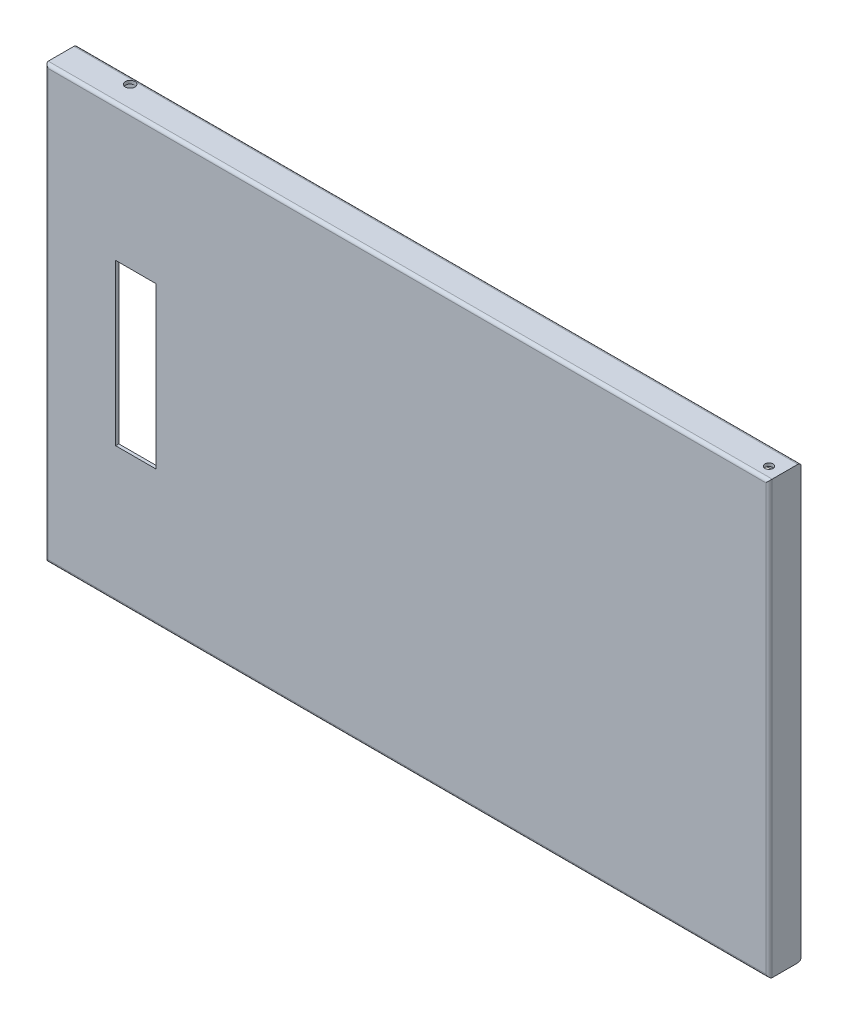
ISO-10303-21;
HEADER;
FILE_DESCRIPTION(('STEP AP214'),'2;1');
FILE_NAME('part.step','',(''),(''),'','','');
FILE_SCHEMA(('AUTOMOTIVE_DESIGN { 1 0 10303 214 1 1 1 1 }'));
ENDSEC;
DATA;
#1=APPLICATION_CONTEXT('core data for automotive mechanical design processes');
#2=APPLICATION_PROTOCOL_DEFINITION('international standard','automotive_design',2000,#1);
#3=PRODUCT_CONTEXT('',#1,'mechanical');
#4=PRODUCT('Part','Part','',(#3));
#5=PRODUCT_RELATED_PRODUCT_CATEGORY('part','',(#4));
#6=PRODUCT_DEFINITION_FORMATION('','',#4);
#7=PRODUCT_DEFINITION_CONTEXT('part definition',#1,'design');
#8=PRODUCT_DEFINITION('design','',#6,#7);
#9=PRODUCT_DEFINITION_SHAPE('','',#8);
#10=(LENGTH_UNIT() NAMED_UNIT(*) SI_UNIT(.MILLI.,.METRE.));
#11=(NAMED_UNIT(*) PLANE_ANGLE_UNIT() SI_UNIT($,.RADIAN.));
#12=(NAMED_UNIT(*) SI_UNIT($,.STERADIAN.) SOLID_ANGLE_UNIT());
#13=UNCERTAINTY_MEASURE_WITH_UNIT(LENGTH_MEASURE(1.E-05),#10,'distance_accuracy_value','');
#14=(GEOMETRIC_REPRESENTATION_CONTEXT(3) GLOBAL_UNCERTAINTY_ASSIGNED_CONTEXT((#13)) GLOBAL_UNIT_ASSIGNED_CONTEXT((#10,
#11,#12)) REPRESENTATION_CONTEXT('',''));
#15=CARTESIAN_POINT('',(0.,0.,0.));
#16=DIRECTION('',(0.,0.,1.));
#17=DIRECTION('',(1.,0.,0.));
#18=AXIS2_PLACEMENT_3D('',#15,#16,#17);
#19=CARTESIAN_POINT('',(225.5,134.5,20.));
#20=DIRECTION('',(-1.,0.,0.));
#21=DIRECTION('',(0.,0.,1.));
#22=AXIS2_PLACEMENT_3D('',#19,#20,#21);
#23=PLANE('',#22);
#24=DIRECTION('',(0.,0.,-1.));
#25=VECTOR('',#24,1.);
#26=CARTESIAN_POINT('',(225.5,-134.5,20.));
#27=LINE('',#26,#25);
#28=CARTESIAN_POINT('',(225.5,-134.5,18.));
#29=VERTEX_POINT('',#28);
#30=CARTESIAN_POINT('',(225.5,-134.5,2.));
#31=VERTEX_POINT('',#30);
#32=EDGE_CURVE('E413',#29,#31,#27,.T.);
#33=ORIENTED_EDGE('',*,*,#32,.T.);
#34=CARTESIAN_POINT('',(225.5,-132.5,2.));
#35=DIRECTION('',(-1.,0.,0.));
#36=DIRECTION('',(0.,0.,1.));
#37=AXIS2_PLACEMENT_3D('',#34,#35,#36);
#38=CIRCLE('',#37,2.);
#39=CARTESIAN_POINT('',(225.5,-132.5,0.));
#40=VERTEX_POINT('',#39);
#41=EDGE_CURVE('E219',#31,#40,#38,.F.);
#42=ORIENTED_EDGE('',*,*,#41,.T.);
#43=DIRECTION('',(0.,1.,0.));
#44=VECTOR('',#43,1.);
#45=CARTESIAN_POINT('',(225.5,134.5,0.));
#46=LINE('',#45,#44);
#47=CARTESIAN_POINT('',(225.5,132.5,0.));
#48=VERTEX_POINT('',#47);
#49=EDGE_CURVE('E419',#40,#48,#46,.T.);
#50=ORIENTED_EDGE('',*,*,#49,.T.);
#51=CARTESIAN_POINT('',(225.5,132.5,2.));
#52=DIRECTION('',(-1.,0.,0.));
#53=DIRECTION('',(0.,0.,1.));
#54=AXIS2_PLACEMENT_3D('',#51,#52,#53);
#55=CIRCLE('',#54,2.);
#56=CARTESIAN_POINT('',(225.5,134.5,2.));
#57=VERTEX_POINT('',#56);
#58=EDGE_CURVE('E230',#48,#57,#55,.F.);
#59=ORIENTED_EDGE('',*,*,#58,.T.);
#60=DIRECTION('',(0.,0.,-1.));
#61=VECTOR('',#60,1.);
#62=CARTESIAN_POINT('',(225.5,134.5,20.));
#63=LINE('',#62,#61);
#64=CARTESIAN_POINT('',(225.5,134.5,18.));
#65=VERTEX_POINT('',#64);
#66=EDGE_CURVE('E224',#65,#57,#63,.T.);
#67=ORIENTED_EDGE('',*,*,#66,.F.);
#68=DIRECTION('',(0.,1.,0.));
#69=VECTOR('',#68,1.);
#70=CARTESIAN_POINT('',(225.5,-134.5,18.));
#71=LINE('',#70,#69);
#72=EDGE_CURVE('E223',#65,#29,#71,.F.);
#73=ORIENTED_EDGE('',*,*,#72,.T.);
#74=EDGE_LOOP('',(#33,#42,#50,#59,#67,#73));
#75=FACE_BOUND('',#74,.T.);
#76=ADVANCED_FACE('F33',(#75),#23,.F.);
#77=CARTESIAN_POINT('',(-225.5,134.5,20.));
#78=DIRECTION('',(0.,-1.,0.));
#79=DIRECTION('',(0.,0.,-1.));
#80=AXIS2_PLACEMENT_3D('',#77,#78,#79);
#81=PLANE('',#80);
#82=CARTESIAN_POINT('',(217.5,134.5,12.));
#83=DIRECTION('',(0.,-1.,0.));
#84=DIRECTION('',(0.,0.,-1.));
#85=AXIS2_PLACEMENT_3D('',#82,#83,#84);
#86=CIRCLE('',#85,2.5);
#87=CARTESIAN_POINT('',(217.5,134.5,9.50000000000001));
#88=VERTEX_POINT('',#87);
#89=EDGE_CURVE('E617',#88,#88,#86,.T.);
#90=ORIENTED_EDGE('',*,*,#89,.T.);
#91=EDGE_LOOP('',(#90));
#92=FACE_BOUND('',#91,.T.);
#93=DIRECTION('',(-1.,0.,0.));
#94=VECTOR('',#93,1.);
#95=CARTESIAN_POINT('',(-225.5,134.5,2.));
#96=LINE('',#95,#94);
#97=CARTESIAN_POINT('',(-187.5,134.5,2.));
#98=VERTEX_POINT('',#97);
#99=EDGE_CURVE('E246',#57,#98,#96,.T.);
#100=ORIENTED_EDGE('',*,*,#99,.T.);
#101=CARTESIAN_POINT('',(-187.5,134.5,5.));
#102=DIRECTION('',(0.,1.,0.));
#103=DIRECTION('',(0.,0.,1.));
#104=AXIS2_PLACEMENT_3D('',#101,#102,#103);
#105=CIRCLE('',#104,2.99999999999999);
#106=EDGE_CURVE('E441',#98,#98,#105,.T.);
#107=ORIENTED_EDGE('',*,*,#106,.F.);
#108=CARTESIAN_POINT('',(-225.5,134.5,2.));
#109=VERTEX_POINT('',#108);
#110=EDGE_CURVE('E245',#98,#109,#96,.T.);
#111=ORIENTED_EDGE('',*,*,#110,.T.);
#112=DIRECTION('',(0.,0.,-1.));
#113=VECTOR('',#112,1.);
#114=CARTESIAN_POINT('',(-225.5,134.5,20.));
#115=LINE('',#114,#113);
#116=CARTESIAN_POINT('',(-225.5,134.5,18.));
#117=VERTEX_POINT('',#116);
#118=EDGE_CURVE('E421',#117,#109,#115,.T.);
#119=ORIENTED_EDGE('',*,*,#118,.F.);
#120=DIRECTION('',(-1.,0.,0.));
#121=VECTOR('',#120,1.);
#122=CARTESIAN_POINT('',(225.5,134.5,18.));
#123=LINE('',#122,#121);
#124=EDGE_CURVE('E243',#117,#65,#123,.F.);
#125=ORIENTED_EDGE('',*,*,#124,.T.);
#126=ORIENTED_EDGE('',*,*,#66,.T.);
#127=EDGE_LOOP('',(#100,#107,#111,#119,#125,#126));
#128=FACE_BOUND('',#127,.T.);
#129=ADVANCED_FACE('F404',(#92,#128),#81,.F.);
#130=CARTESIAN_POINT('',(-225.5,134.5,20.));
#131=DIRECTION('',(1.,0.,0.));
#132=DIRECTION('',(0.,0.,-1.));
#133=AXIS2_PLACEMENT_3D('',#130,#131,#132);
#134=PLANE('',#133);
#135=ORIENTED_EDGE('',*,*,#118,.T.);
#136=DIRECTION('',(0.,-1.,0.));
#137=VECTOR('',#136,1.);
#138=CARTESIAN_POINT('',(-225.5,134.5,2.));
#139=LINE('',#138,#137);
#140=CARTESIAN_POINT('',(-225.5,-134.5,2.));
#141=VERTEX_POINT('',#140);
#142=EDGE_CURVE('E241',#109,#141,#139,.T.);
#143=ORIENTED_EDGE('',*,*,#142,.T.);
#144=DIRECTION('',(0.,0.,-1.));
#145=VECTOR('',#144,1.);
#146=CARTESIAN_POINT('',(-225.5,-134.5,20.));
#147=LINE('',#146,#145);
#148=CARTESIAN_POINT('',(-225.5,-134.5,18.));
#149=VERTEX_POINT('',#148);
#150=EDGE_CURVE('E418',#149,#141,#147,.T.);
#151=ORIENTED_EDGE('',*,*,#150,.F.);
#152=DIRECTION('',(0.,-1.,0.));
#153=VECTOR('',#152,1.);
#154=CARTESIAN_POINT('',(-225.5,134.5,18.));
#155=LINE('',#154,#153);
#156=EDGE_CURVE('E239',#149,#117,#155,.F.);
#157=ORIENTED_EDGE('',*,*,#156,.T.);
#158=EDGE_LOOP('',(#135,#143,#151,#157));
#159=FACE_BOUND('',#158,.T.);
#160=ADVANCED_FACE('F400',(#159),#134,.F.);
#161=CARTESIAN_POINT('',(-225.5,-134.5,20.));
#162=DIRECTION('',(0.,1.,0.));
#163=DIRECTION('',(0.,0.,1.));
#164=AXIS2_PLACEMENT_3D('',#161,#162,#163);
#165=PLANE('',#164);
#166=CARTESIAN_POINT('',(217.5,-134.5,12.));
#167=DIRECTION('',(0.,-1.,0.));
#168=DIRECTION('',(0.,0.,-1.));
#169=AXIS2_PLACEMENT_3D('',#166,#167,#168);
#170=CIRCLE('',#169,2.5);
#171=CARTESIAN_POINT('',(217.5,-134.5,9.50000000000001));
#172=VERTEX_POINT('',#171);
#173=EDGE_CURVE('E614',#172,#172,#170,.T.);
#174=ORIENTED_EDGE('',*,*,#173,.F.);
#175=EDGE_LOOP('',(#174));
#176=FACE_BOUND('',#175,.T.);
#177=DIRECTION('',(1.,0.,0.));
#178=VECTOR('',#177,1.);
#179=CARTESIAN_POINT('',(-225.5,-134.5,2.));
#180=LINE('',#179,#178);
#181=CARTESIAN_POINT('',(-153.717974555896,-134.5,2.));
#182=VERTEX_POINT('',#181);
#183=EDGE_CURVE('E214',#141,#182,#180,.T.);
#184=ORIENTED_EDGE('',*,*,#183,.T.);
#185=CARTESIAN_POINT('',(-150.5,-134.5,5.));
#186=DIRECTION('',(0.,-1.,0.));
#187=DIRECTION('',(0.,0.,-1.));
#188=AXIS2_PLACEMENT_3D('',#185,#186,#187);
#189=CIRCLE('',#188,4.39947272322456);
#190=CARTESIAN_POINT('',(-147.282025444104,-134.5,2.));
#191=VERTEX_POINT('',#190);
#192=EDGE_CURVE('E54',#191,#182,#189,.T.);
#193=ORIENTED_EDGE('',*,*,#192,.F.);
#194=EDGE_CURVE('E211',#191,#31,#180,.T.);
#195=ORIENTED_EDGE('',*,*,#194,.T.);
#196=ORIENTED_EDGE('',*,*,#32,.F.);
#197=DIRECTION('',(1.,0.,0.));
#198=VECTOR('',#197,1.);
#199=CARTESIAN_POINT('',(-225.5,-134.5,18.));
#200=LINE('',#199,#198);
#201=EDGE_CURVE('E221',#29,#149,#200,.F.);
#202=ORIENTED_EDGE('',*,*,#201,.T.);
#203=ORIENTED_EDGE('',*,*,#150,.T.);
#204=EDGE_LOOP('',(#184,#193,#195,#196,#202,#203));
#205=FACE_BOUND('',#204,.T.);
#206=ADVANCED_FACE('F209',(#176,#205),#165,.F.);
#207=CARTESIAN_POINT('',(0.,0.,20.));
#208=DIRECTION('',(0.,0.,1.));
#209=DIRECTION('',(1.,0.,0.));
#210=AXIS2_PLACEMENT_3D('',#207,#208,#209);
#211=PLANE('',#210);
#212=DIRECTION('',(1.,0.,0.));
#213=VECTOR('',#212,1.);
#214=CARTESIAN_POINT('',(225.5,-132.5,20.));
#215=LINE('',#214,#213);
#216=CARTESIAN_POINT('',(-223.5,-132.5,20.));
#217=VERTEX_POINT('',#216);
#218=CARTESIAN_POINT('',(223.5,-132.5,20.));
#219=VERTEX_POINT('',#218);
#220=EDGE_CURVE('E263',#217,#219,#215,.T.);
#221=ORIENTED_EDGE('',*,*,#220,.T.);
#222=DIRECTION('',(0.,1.,0.));
#223=VECTOR('',#222,1.);
#224=CARTESIAN_POINT('',(223.5,134.5,20.));
#225=LINE('',#224,#223);
#226=CARTESIAN_POINT('',(223.5,132.5,20.));
#227=VERTEX_POINT('',#226);
#228=EDGE_CURVE('E265',#219,#227,#225,.T.);
#229=ORIENTED_EDGE('',*,*,#228,.T.);
#230=DIRECTION('',(-1.,0.,0.));
#231=VECTOR('',#230,1.);
#232=CARTESIAN_POINT('',(-225.5,132.5,20.));
#233=LINE('',#232,#231);
#234=CARTESIAN_POINT('',(-223.5,132.5,20.));
#235=VERTEX_POINT('',#234);
#236=EDGE_CURVE('E259',#227,#235,#233,.T.);
#237=ORIENTED_EDGE('',*,*,#236,.T.);
#238=DIRECTION('',(0.,-1.,0.));
#239=VECTOR('',#238,1.);
#240=CARTESIAN_POINT('',(-223.5,-134.5,20.));
#241=LINE('',#240,#239);
#242=EDGE_CURVE('E261',#235,#217,#241,.T.);
#243=ORIENTED_EDGE('',*,*,#242,.T.);
#244=EDGE_LOOP('',(#221,#229,#237,#243));
#245=FACE_BOUND('',#244,.T.);
#246=DIRECTION('',(1.,0.,0.));
#247=VECTOR('',#246,1.);
#248=CARTESIAN_POINT('',(-181.5,-50.,20.));
#249=LINE('',#248,#247);
#250=CARTESIAN_POINT('',(-181.5,-50.,20.));
#251=VERTEX_POINT('',#250);
#252=CARTESIAN_POINT('',(-156.5,-50.,20.));
#253=VERTEX_POINT('',#252);
#254=EDGE_CURVE('E601',#251,#253,#249,.T.);
#255=ORIENTED_EDGE('',*,*,#254,.F.);
#256=DIRECTION('',(0.,-1.,0.));
#257=VECTOR('',#256,1.);
#258=CARTESIAN_POINT('',(-181.5,50.,20.));
#259=LINE('',#258,#257);
#260=CARTESIAN_POINT('',(-181.5,50.,20.));
#261=VERTEX_POINT('',#260);
#262=EDGE_CURVE('E276',#261,#251,#259,.T.);
#263=ORIENTED_EDGE('',*,*,#262,.F.);
#264=DIRECTION('',(-1.,0.,0.));
#265=VECTOR('',#264,1.);
#266=CARTESIAN_POINT('',(-181.5,50.,20.));
#267=LINE('',#266,#265);
#268=CARTESIAN_POINT('',(-156.5,50.,20.));
#269=VERTEX_POINT('',#268);
#270=EDGE_CURVE('E598',#269,#261,#267,.T.);
#271=ORIENTED_EDGE('',*,*,#270,.F.);
#272=DIRECTION('',(0.,1.,0.));
#273=VECTOR('',#272,1.);
#274=CARTESIAN_POINT('',(-156.5,50.,20.));
#275=LINE('',#274,#273);
#276=EDGE_CURVE('E604',#253,#269,#275,.T.);
#277=ORIENTED_EDGE('',*,*,#276,.F.);
#278=EDGE_LOOP('',(#255,#263,#271,#277));
#279=FACE_BOUND('',#278,.T.);
#280=ADVANCED_FACE('F391',(#245,#279),#211,.T.);
#281=CARTESIAN_POINT('',(0.,0.,0.));
#282=DIRECTION('',(0.,0.,1.));
#283=DIRECTION('',(1.,0.,0.));
#284=AXIS2_PLACEMENT_3D('',#281,#282,#283);
#285=PLANE('',#284);
#286=DIRECTION('',(1.,0.,0.));
#287=VECTOR('',#286,1.);
#288=CARTESIAN_POINT('',(-225.5,-123.5,0.));
#289=LINE('',#288,#287);
#290=CARTESIAN_POINT('',(-214.5,-123.5,0.));
#291=VERTEX_POINT('',#290);
#292=CARTESIAN_POINT('',(214.5,-123.5,0.));
#293=VERTEX_POINT('',#292);
#294=EDGE_CURVE('E532',#291,#293,#289,.T.);
#295=ORIENTED_EDGE('',*,*,#294,.T.);
#296=DIRECTION('',(0.,1.,0.));
#297=VECTOR('',#296,1.);
#298=CARTESIAN_POINT('',(214.5,134.5,0.));
#299=LINE('',#298,#297);
#300=CARTESIAN_POINT('',(214.5,123.5,0.));
#301=VERTEX_POINT('',#300);
#302=EDGE_CURVE('E526',#293,#301,#299,.T.);
#303=ORIENTED_EDGE('',*,*,#302,.T.);
#304=DIRECTION('',(-1.,0.,0.));
#305=VECTOR('',#304,1.);
#306=CARTESIAN_POINT('',(-225.5,123.5,0.));
#307=LINE('',#306,#305);
#308=CARTESIAN_POINT('',(-214.5,123.5,0.));
#309=VERTEX_POINT('',#308);
#310=EDGE_CURVE('E537',#301,#309,#307,.T.);
#311=ORIENTED_EDGE('',*,*,#310,.T.);
#312=DIRECTION('',(0.,-1.,0.));
#313=VECTOR('',#312,1.);
#314=CARTESIAN_POINT('',(-214.5,134.5,0.));
#315=LINE('',#314,#313);
#316=EDGE_CURVE('E540',#309,#291,#315,.T.);
#317=ORIENTED_EDGE('',*,*,#316,.T.);
#318=EDGE_LOOP('',(#295,#303,#311,#317));
#319=FACE_BOUND('',#318,.T.);
#320=ORIENTED_EDGE('',*,*,#49,.F.);
#321=DIRECTION('',(1.,0.,0.));
#322=VECTOR('',#321,1.);
#323=CARTESIAN_POINT('',(0.,-132.5,0.));
#324=LINE('',#323,#322);
#325=CARTESIAN_POINT('',(-223.5,-132.5,0.));
#326=VERTEX_POINT('',#325);
#327=EDGE_CURVE('E237',#40,#326,#324,.F.);
#328=ORIENTED_EDGE('',*,*,#327,.T.);
#329=DIRECTION('',(0.,-1.,0.));
#330=VECTOR('',#329,1.);
#331=CARTESIAN_POINT('',(-223.5,0.,0.));
#332=LINE('',#331,#330);
#333=CARTESIAN_POINT('',(-223.5,132.5,0.));
#334=VERTEX_POINT('',#333);
#335=EDGE_CURVE('E235',#326,#334,#332,.F.);
#336=ORIENTED_EDGE('',*,*,#335,.T.);
#337=DIRECTION('',(-1.,0.,0.));
#338=VECTOR('',#337,1.);
#339=CARTESIAN_POINT('',(0.,132.5,0.));
#340=LINE('',#339,#338);
#341=EDGE_CURVE('E233',#334,#48,#340,.F.);
#342=ORIENTED_EDGE('',*,*,#341,.T.);
#343=EDGE_LOOP('',(#320,#328,#336,#342));
#344=FACE_BOUND('',#343,.T.);
#345=ADVANCED_FACE('F379',(#319,#344),#285,.F.);
#346=CARTESIAN_POINT('',(214.5,134.5,20.));
#347=DIRECTION('',(-1.,0.,0.));
#348=DIRECTION('',(0.,0.,1.));
#349=AXIS2_PLACEMENT_3D('',#346,#347,#348);
#350=PLANE('',#349);
#351=DIRECTION('',(0.,-1.,0.));
#352=VECTOR('',#351,1.);
#353=CARTESIAN_POINT('',(214.5,123.5,2.));
#354=LINE('',#353,#352);
#355=CARTESIAN_POINT('',(214.5,123.5,2.));
#356=VERTEX_POINT('',#355);
#357=CARTESIAN_POINT('',(214.5,-123.5,2.));
#358=VERTEX_POINT('',#357);
#359=EDGE_CURVE('E522',#356,#358,#354,.T.);
#360=ORIENTED_EDGE('',*,*,#359,.F.);
#361=DIRECTION('',(0.,0.,-1.));
#362=VECTOR('',#361,1.);
#363=CARTESIAN_POINT('',(214.5,123.5,20.));
#364=LINE('',#363,#362);
#365=EDGE_CURVE('E423',#356,#301,#364,.T.);
#366=ORIENTED_EDGE('',*,*,#365,.T.);
#367=ORIENTED_EDGE('',*,*,#302,.F.);
#368=DIRECTION('',(0.,0.,-1.));
#369=VECTOR('',#368,1.);
#370=CARTESIAN_POINT('',(214.5,-123.5,20.));
#371=LINE('',#370,#369);
#372=EDGE_CURVE('E529',#358,#293,#371,.T.);
#373=ORIENTED_EDGE('',*,*,#372,.F.);
#374=EDGE_LOOP('',(#360,#366,#367,#373));
#375=FACE_BOUND('',#374,.T.);
#376=ADVANCED_FACE('F375',(#375),#350,.T.);
#377=CARTESIAN_POINT('',(-225.5,123.5,20.));
#378=DIRECTION('',(0.,-1.,0.));
#379=DIRECTION('',(0.,0.,-1.));
#380=AXIS2_PLACEMENT_3D('',#377,#378,#379);
#381=PLANE('',#380);
#382=DIRECTION('',(1.,0.,0.));
#383=VECTOR('',#382,1.);
#384=CARTESIAN_POINT('',(223.5,123.5,2.));
#385=LINE('',#384,#383);
#386=CARTESIAN_POINT('',(-214.5,123.5,2.));
#387=VERTEX_POINT('',#386);
#388=EDGE_CURVE('E513',#387,#356,#385,.T.);
#389=ORIENTED_EDGE('',*,*,#388,.F.);
#390=DIRECTION('',(0.,0.,-1.));
#391=VECTOR('',#390,1.);
#392=CARTESIAN_POINT('',(-214.5,123.5,20.));
#393=LINE('',#392,#391);
#394=EDGE_CURVE('E528',#387,#309,#393,.T.);
#395=ORIENTED_EDGE('',*,*,#394,.T.);
#396=ORIENTED_EDGE('',*,*,#310,.F.);
#397=ORIENTED_EDGE('',*,*,#365,.F.);
#398=EDGE_LOOP('',(#389,#395,#396,#397));
#399=FACE_BOUND('',#398,.T.);
#400=ADVANCED_FACE('F378',(#399),#381,.T.);
#401=CARTESIAN_POINT('',(-214.5,134.5,20.));
#402=DIRECTION('',(1.,0.,0.));
#403=DIRECTION('',(0.,0.,-1.));
#404=AXIS2_PLACEMENT_3D('',#401,#402,#403);
#405=PLANE('',#404);
#406=DIRECTION('',(0.,1.,0.));
#407=VECTOR('',#406,1.);
#408=CARTESIAN_POINT('',(-214.5,132.5,2.));
#409=LINE('',#408,#407);
#410=CARTESIAN_POINT('',(-214.5,-123.5,2.));
#411=VERTEX_POINT('',#410);
#412=EDGE_CURVE('E520',#411,#387,#409,.T.);
#413=ORIENTED_EDGE('',*,*,#412,.F.);
#414=DIRECTION('',(0.,0.,-1.));
#415=VECTOR('',#414,1.);
#416=CARTESIAN_POINT('',(-214.5,-123.5,20.));
#417=LINE('',#416,#415);
#418=EDGE_CURVE('E531',#411,#291,#417,.T.);
#419=ORIENTED_EDGE('',*,*,#418,.T.);
#420=ORIENTED_EDGE('',*,*,#316,.F.);
#421=ORIENTED_EDGE('',*,*,#394,.F.);
#422=EDGE_LOOP('',(#413,#419,#420,#421));
#423=FACE_BOUND('',#422,.T.);
#424=ADVANCED_FACE('F383',(#423),#405,.T.);
#425=CARTESIAN_POINT('',(-225.5,-123.5,20.));
#426=DIRECTION('',(0.,1.,0.));
#427=DIRECTION('',(0.,0.,1.));
#428=AXIS2_PLACEMENT_3D('',#425,#426,#427);
#429=PLANE('',#428);
#430=DIRECTION('',(-1.,0.,0.));
#431=VECTOR('',#430,1.);
#432=CARTESIAN_POINT('',(-223.5,-123.5,2.));
#433=LINE('',#432,#431);
#434=EDGE_CURVE('E554',#358,#411,#433,.T.);
#435=ORIENTED_EDGE('',*,*,#434,.F.);
#436=ORIENTED_EDGE('',*,*,#372,.T.);
#437=ORIENTED_EDGE('',*,*,#294,.F.);
#438=ORIENTED_EDGE('',*,*,#418,.F.);
#439=EDGE_LOOP('',(#435,#436,#437,#438));
#440=FACE_BOUND('',#439,.T.);
#441=ADVANCED_FACE('F373',(#440),#429,.T.);
#442=CARTESIAN_POINT('',(0.,0.,18.));
#443=DIRECTION('',(0.,0.,-1.));
#444=DIRECTION('',(-1.,0.,0.));
#445=AXIS2_PLACEMENT_3D('',#442,#443,#444);
#446=PLANE('',#445);
#447=DIRECTION('',(-1.,0.,0.));
#448=VECTOR('',#447,1.);
#449=CARTESIAN_POINT('',(0.,130.5,18.));
#450=LINE('',#449,#448);
#451=CARTESIAN_POINT('',(-221.5,130.5,18.));
#452=VERTEX_POINT('',#451);
#453=CARTESIAN_POINT('',(221.5,130.5,18.));
#454=VERTEX_POINT('',#453);
#455=EDGE_CURVE('E289',#452,#454,#450,.F.);
#456=ORIENTED_EDGE('',*,*,#455,.T.);
#457=DIRECTION('',(0.,1.,0.));
#458=VECTOR('',#457,1.);
#459=CARTESIAN_POINT('',(221.5,0.,18.));
#460=LINE('',#459,#458);
#461=CARTESIAN_POINT('',(221.5,-130.5,18.));
#462=VERTEX_POINT('',#461);
#463=EDGE_CURVE('E295',#454,#462,#460,.F.);
#464=ORIENTED_EDGE('',*,*,#463,.T.);
#465=DIRECTION('',(1.,0.,0.));
#466=VECTOR('',#465,1.);
#467=CARTESIAN_POINT('',(0.,-130.5,18.));
#468=LINE('',#467,#466);
#469=CARTESIAN_POINT('',(-221.5,-130.5,18.));
#470=VERTEX_POINT('',#469);
#471=EDGE_CURVE('E293',#462,#470,#468,.F.);
#472=ORIENTED_EDGE('',*,*,#471,.T.);
#473=DIRECTION('',(0.,-1.,0.));
#474=VECTOR('',#473,1.);
#475=CARTESIAN_POINT('',(-221.5,132.5,18.));
#476=LINE('',#475,#474);
#477=EDGE_CURVE('E291',#470,#452,#476,.F.);
#478=ORIENTED_EDGE('',*,*,#477,.T.);
#479=EDGE_LOOP('',(#456,#464,#472,#478));
#480=FACE_BOUND('',#479,.T.);
#481=DIRECTION('',(1.,0.,0.));
#482=VECTOR('',#481,1.);
#483=CARTESIAN_POINT('',(-181.5,-50.,18.));
#484=LINE('',#483,#482);
#485=CARTESIAN_POINT('',(-181.5,-50.,18.));
#486=VERTEX_POINT('',#485);
#487=CARTESIAN_POINT('',(-156.5,-50.,18.));
#488=VERTEX_POINT('',#487);
#489=EDGE_CURVE('E583',#486,#488,#484,.T.);
#490=ORIENTED_EDGE('',*,*,#489,.T.);
#491=DIRECTION('',(0.,1.,0.));
#492=VECTOR('',#491,1.);
#493=CARTESIAN_POINT('',(-156.5,50.,18.));
#494=LINE('',#493,#492);
#495=CARTESIAN_POINT('',(-156.5,50.,18.));
#496=VERTEX_POINT('',#495);
#497=EDGE_CURVE('E582',#488,#496,#494,.T.);
#498=ORIENTED_EDGE('',*,*,#497,.T.);
#499=DIRECTION('',(-1.,0.,0.));
#500=VECTOR('',#499,1.);
#501=CARTESIAN_POINT('',(-181.5,50.,18.));
#502=LINE('',#501,#500);
#503=CARTESIAN_POINT('',(-181.5,50.,18.));
#504=VERTEX_POINT('',#503);
#505=EDGE_CURVE('E586',#496,#504,#502,.T.);
#506=ORIENTED_EDGE('',*,*,#505,.T.);
#507=DIRECTION('',(0.,-1.,0.));
#508=VECTOR('',#507,1.);
#509=CARTESIAN_POINT('',(-181.5,50.,18.));
#510=LINE('',#509,#508);
#511=EDGE_CURVE('E579',#504,#486,#510,.T.);
#512=ORIENTED_EDGE('',*,*,#511,.T.);
#513=EDGE_LOOP('',(#490,#498,#506,#512));
#514=FACE_BOUND('',#513,.T.);
#515=ADVANCED_FACE('F369',(#480,#514),#446,.T.);
#516=CARTESIAN_POINT('',(223.5,123.5,2.));
#517=DIRECTION('',(0.,0.,-1.));
#518=DIRECTION('',(0.,1.,0.));
#519=AXIS2_PLACEMENT_3D('',#516,#517,#518);
#520=PLANE('',#519);
#521=ORIENTED_EDGE('',*,*,#359,.T.);
#522=ORIENTED_EDGE('',*,*,#434,.T.);
#523=ORIENTED_EDGE('',*,*,#412,.T.);
#524=ORIENTED_EDGE('',*,*,#388,.T.);
#525=EDGE_LOOP('',(#521,#522,#523,#524));
#526=FACE_BOUND('',#525,.T.);
#527=DIRECTION('',(-1.,0.,0.));
#528=VECTOR('',#527,1.);
#529=CARTESIAN_POINT('',(-223.5,-132.5,2.));
#530=LINE('',#529,#528);
#531=CARTESIAN_POINT('',(221.5,-132.5,2.));
#532=VERTEX_POINT('',#531);
#533=CARTESIAN_POINT('',(-147.282025444104,-132.5,2.00000000000001));
#534=VERTEX_POINT('',#533);
#535=EDGE_CURVE('E558',#532,#534,#530,.T.);
#536=ORIENTED_EDGE('',*,*,#535,.F.);
#537=DIRECTION('',(0.,-1.,0.));
#538=VECTOR('',#537,1.);
#539=CARTESIAN_POINT('',(221.5,132.5,2.));
#540=LINE('',#539,#538);
#541=CARTESIAN_POINT('',(221.5,132.5,2.));
#542=VERTEX_POINT('',#541);
#543=EDGE_CURVE('E254',#532,#542,#540,.F.);
#544=ORIENTED_EDGE('',*,*,#543,.T.);
#545=DIRECTION('',(1.,0.,0.));
#546=VECTOR('',#545,1.);
#547=CARTESIAN_POINT('',(223.5,132.5,2.));
#548=LINE('',#547,#546);
#549=CARTESIAN_POINT('',(-187.5,132.5,1.99999999999995));
#550=VERTEX_POINT('',#549);
#551=EDGE_CURVE('E512',#550,#542,#548,.T.);
#552=ORIENTED_EDGE('',*,*,#551,.F.);
#553=CARTESIAN_POINT('',(-223.5,132.5,2.));
#554=VERTEX_POINT('',#553);
#555=EDGE_CURVE('E515',#554,#550,#548,.T.);
#556=ORIENTED_EDGE('',*,*,#555,.F.);
#557=DIRECTION('',(0.,1.,0.));
#558=VECTOR('',#557,1.);
#559=CARTESIAN_POINT('',(-223.5,132.5,2.));
#560=LINE('',#559,#558);
#561=CARTESIAN_POINT('',(-223.5,-132.5,2.));
#562=VERTEX_POINT('',#561);
#563=EDGE_CURVE('E557',#562,#554,#560,.T.);
#564=ORIENTED_EDGE('',*,*,#563,.F.);
#565=CARTESIAN_POINT('',(-153.717974555896,-132.5,2.));
#566=VERTEX_POINT('',#565);
#567=EDGE_CURVE('E564',#566,#562,#530,.T.);
#568=ORIENTED_EDGE('',*,*,#567,.F.);
#569=EDGE_CURVE('E562',#534,#566,#530,.T.);
#570=ORIENTED_EDGE('',*,*,#569,.F.);
#571=EDGE_LOOP('',(#536,#544,#552,#556,#564,#568,#570));
#572=FACE_BOUND('',#571,.T.);
#573=ADVANCED_FACE('F365',(#526,#572),#520,.F.);
#574=CARTESIAN_POINT('',(223.5,0.,0.));
#575=DIRECTION('',(1.,0.,0.));
#576=DIRECTION('',(0.,0.,-1.));
#577=AXIS2_PLACEMENT_3D('',#574,#575,#576);
#578=PLANE('',#577);
#579=DIRECTION('',(0.,0.,-1.));
#580=VECTOR('',#579,1.);
#581=CARTESIAN_POINT('',(223.5,-132.5,18.));
#582=LINE('',#581,#580);
#583=CARTESIAN_POINT('',(223.5,-132.5,16.));
#584=VERTEX_POINT('',#583);
#585=CARTESIAN_POINT('',(223.5,-132.5,4.00000000000003));
#586=VERTEX_POINT('',#585);
#587=EDGE_CURVE('E509',#584,#586,#582,.T.);
#588=ORIENTED_EDGE('',*,*,#587,.F.);
#589=DIRECTION('',(0.,1.,0.));
#590=VECTOR('',#589,1.);
#591=CARTESIAN_POINT('',(223.5,0.,16.));
#592=LINE('',#591,#590);
#593=CARTESIAN_POINT('',(223.5,132.5,16.));
#594=VERTEX_POINT('',#593);
#595=EDGE_CURVE('E268',#584,#594,#592,.T.);
#596=ORIENTED_EDGE('',*,*,#595,.T.);
#597=DIRECTION('',(0.,0.,1.));
#598=VECTOR('',#597,1.);
#599=CARTESIAN_POINT('',(223.5,132.5,18.));
#600=LINE('',#599,#598);
#601=CARTESIAN_POINT('',(223.5,132.5,4.));
#602=VERTEX_POINT('',#601);
#603=EDGE_CURVE('E507',#602,#594,#600,.T.);
#604=ORIENTED_EDGE('',*,*,#603,.F.);
#605=DIRECTION('',(0.,-1.,0.));
#606=VECTOR('',#605,1.);
#607=CARTESIAN_POINT('',(223.5,-132.5,4.00000000000003));
#608=LINE('',#607,#606);
#609=EDGE_CURVE('E249',#602,#586,#608,.T.);
#610=ORIENTED_EDGE('',*,*,#609,.T.);
#611=EDGE_LOOP('',(#588,#596,#604,#610));
#612=FACE_BOUND('',#611,.T.);
#613=ADVANCED_FACE('F361',(#612),#578,.F.);
#614=CARTESIAN_POINT('',(0.,132.5,0.));
#615=DIRECTION('',(0.,1.,0.));
#616=DIRECTION('',(0.,0.,1.));
#617=AXIS2_PLACEMENT_3D('',#614,#615,#616);
#618=PLANE('',#617);
#619=CARTESIAN_POINT('',(217.5,132.5,12.));
#620=DIRECTION('',(0.,1.,0.));
#621=DIRECTION('',(0.,0.,1.));
#622=AXIS2_PLACEMENT_3D('',#619,#620,#621);
#623=CIRCLE('',#622,2.5);
#624=CARTESIAN_POINT('',(217.5,132.5,14.5));
#625=VERTEX_POINT('',#624);
#626=EDGE_CURVE('E215',#625,#625,#623,.T.);
#627=ORIENTED_EDGE('',*,*,#626,.T.);
#628=EDGE_LOOP('',(#627));
#629=FACE_BOUND('',#628,.T.);
#630=ORIENTED_EDGE('',*,*,#555,.T.);
#631=CARTESIAN_POINT('',(-187.5,132.5,5.));
#632=DIRECTION('',(0.,1.,0.));
#633=DIRECTION('',(0.,0.,1.));
#634=AXIS2_PLACEMENT_3D('',#631,#632,#633);
#635=CIRCLE('',#634,2.99999999999999);
#636=EDGE_CURVE('E306',#550,#550,#635,.F.);
#637=ORIENTED_EDGE('',*,*,#636,.F.);
#638=ORIENTED_EDGE('',*,*,#551,.T.);
#639=CARTESIAN_POINT('',(221.5,132.5,4.));
#640=DIRECTION('',(0.,1.,0.));
#641=DIRECTION('',(0.,0.,1.));
#642=AXIS2_PLACEMENT_3D('',#639,#640,#641);
#643=CIRCLE('',#642,2.);
#644=EDGE_CURVE('E257',#542,#602,#643,.F.);
#645=ORIENTED_EDGE('',*,*,#644,.T.);
#646=ORIENTED_EDGE('',*,*,#603,.T.);
#647=DIRECTION('',(-1.,0.,0.));
#648=VECTOR('',#647,1.);
#649=CARTESIAN_POINT('',(0.,132.5,16.));
#650=LINE('',#649,#648);
#651=CARTESIAN_POINT('',(-223.5,132.5,16.));
#652=VERTEX_POINT('',#651);
#653=EDGE_CURVE('E42',#594,#652,#650,.T.);
#654=ORIENTED_EDGE('',*,*,#653,.T.);
#655=DIRECTION('',(0.,0.,1.));
#656=VECTOR('',#655,1.);
#657=CARTESIAN_POINT('',(-223.5,132.5,18.));
#658=LINE('',#657,#656);
#659=EDGE_CURVE('E517',#554,#652,#658,.T.);
#660=ORIENTED_EDGE('',*,*,#659,.F.);
#661=EDGE_LOOP('',(#630,#637,#638,#645,#646,#654,#660));
#662=FACE_BOUND('',#661,.T.);
#663=ADVANCED_FACE('F357',(#629,#662),#618,.F.);
#664=CARTESIAN_POINT('',(-223.5,0.,0.));
#665=DIRECTION('',(1.,0.,0.));
#666=DIRECTION('',(0.,0.,-1.));
#667=AXIS2_PLACEMENT_3D('',#664,#665,#666);
#668=PLANE('',#667);
#669=ORIENTED_EDGE('',*,*,#659,.T.);
#670=DIRECTION('',(0.,-1.,0.));
#671=VECTOR('',#670,1.);
#672=CARTESIAN_POINT('',(-223.5,-132.5,16.));
#673=LINE('',#672,#671);
#674=CARTESIAN_POINT('',(-223.5,-132.5,16.));
#675=VERTEX_POINT('',#674);
#676=EDGE_CURVE('E300',#652,#675,#673,.T.);
#677=ORIENTED_EDGE('',*,*,#676,.T.);
#678=DIRECTION('',(0.,0.,1.));
#679=VECTOR('',#678,1.);
#680=CARTESIAN_POINT('',(-223.5,-132.5,18.));
#681=LINE('',#680,#679);
#682=EDGE_CURVE('E573',#562,#675,#681,.T.);
#683=ORIENTED_EDGE('',*,*,#682,.F.);
#684=ORIENTED_EDGE('',*,*,#563,.T.);
#685=EDGE_LOOP('',(#669,#677,#683,#684));
#686=FACE_BOUND('',#685,.T.);
#687=ADVANCED_FACE('F353',(#686),#668,.T.);
#688=CARTESIAN_POINT('',(0.,-132.5,0.));
#689=DIRECTION('',(0.,-1.,0.));
#690=DIRECTION('',(0.,0.,-1.));
#691=AXIS2_PLACEMENT_3D('',#688,#689,#690);
#692=PLANE('',#691);
#693=CARTESIAN_POINT('',(217.5,-132.5,12.));
#694=DIRECTION('',(0.,-1.,0.));
#695=DIRECTION('',(0.,0.,-1.));
#696=AXIS2_PLACEMENT_3D('',#693,#694,#695);
#697=CIRCLE('',#696,2.5);
#698=CARTESIAN_POINT('',(217.5,-132.5,9.50000000000001));
#699=VERTEX_POINT('',#698);
#700=EDGE_CURVE('E37',#699,#699,#697,.T.);
#701=ORIENTED_EDGE('',*,*,#700,.T.);
#702=EDGE_LOOP('',(#701));
#703=FACE_BOUND('',#702,.T.);
#704=ORIENTED_EDGE('',*,*,#535,.T.);
#705=CARTESIAN_POINT('',(-150.5,-132.5,5.));
#706=DIRECTION('',(0.,-1.,0.));
#707=DIRECTION('',(0.,0.,-1.));
#708=AXIS2_PLACEMENT_3D('',#705,#706,#707);
#709=CIRCLE('',#708,4.39947272322456);
#710=EDGE_CURVE('E610',#566,#534,#709,.F.);
#711=ORIENTED_EDGE('',*,*,#710,.F.);
#712=ORIENTED_EDGE('',*,*,#567,.T.);
#713=ORIENTED_EDGE('',*,*,#682,.T.);
#714=DIRECTION('',(1.,0.,0.));
#715=VECTOR('',#714,1.);
#716=CARTESIAN_POINT('',(0.,-132.5,16.));
#717=LINE('',#716,#715);
#718=EDGE_CURVE('E298',#675,#584,#717,.T.);
#719=ORIENTED_EDGE('',*,*,#718,.T.);
#720=ORIENTED_EDGE('',*,*,#587,.T.);
#721=CARTESIAN_POINT('',(221.5,-132.5,4.00000000000003));
#722=DIRECTION('',(0.,-1.,0.));
#723=DIRECTION('',(0.,0.,-1.));
#724=AXIS2_PLACEMENT_3D('',#721,#722,#723);
#725=CIRCLE('',#724,2.);
#726=EDGE_CURVE('E252',#586,#532,#725,.F.);
#727=ORIENTED_EDGE('',*,*,#726,.T.);
#728=EDGE_LOOP('',(#704,#711,#712,#713,#719,#720,#727));
#729=FACE_BOUND('',#728,.T.);
#730=ADVANCED_FACE('F349',(#703,#729),#692,.F.);
#731=CARTESIAN_POINT('',(-181.5,-50.,-85.0776406404415));
#732=DIRECTION('',(0.,-1.,0.));
#733=DIRECTION('',(0.,0.,-1.));
#734=AXIS2_PLACEMENT_3D('',#731,#732,#733);
#735=PLANE('',#734);
#736=DIRECTION('',(0.,0.,1.));
#737=VECTOR('',#736,1.);
#738=CARTESIAN_POINT('',(-181.5,-50.,-85.0776406404415));
#739=LINE('',#738,#737);
#740=EDGE_CURVE('E577',#486,#251,#739,.T.);
#741=ORIENTED_EDGE('',*,*,#740,.T.);
#742=ORIENTED_EDGE('',*,*,#254,.T.);
#743=DIRECTION('',(0.,0.,1.));
#744=VECTOR('',#743,1.);
#745=CARTESIAN_POINT('',(-156.5,-50.,-85.0776406404415));
#746=LINE('',#745,#744);
#747=EDGE_CURVE('E580',#488,#253,#746,.T.);
#748=ORIENTED_EDGE('',*,*,#747,.F.);
#749=ORIENTED_EDGE('',*,*,#489,.F.);
#750=EDGE_LOOP('',(#741,#742,#748,#749));
#751=FACE_BOUND('',#750,.T.);
#752=ADVANCED_FACE('F345',(#751),#735,.F.);
#753=CARTESIAN_POINT('',(-156.5,50.,-85.0776406404415));
#754=DIRECTION('',(1.,0.,0.));
#755=DIRECTION('',(0.,1.,0.));
#756=AXIS2_PLACEMENT_3D('',#753,#754,#755);
#757=PLANE('',#756);
#758=ORIENTED_EDGE('',*,*,#747,.T.);
#759=ORIENTED_EDGE('',*,*,#276,.T.);
#760=DIRECTION('',(0.,0.,1.));
#761=VECTOR('',#760,1.);
#762=CARTESIAN_POINT('',(-156.5,50.,-85.0776406404415));
#763=LINE('',#762,#761);
#764=EDGE_CURVE('E584',#496,#269,#763,.T.);
#765=ORIENTED_EDGE('',*,*,#764,.F.);
#766=ORIENTED_EDGE('',*,*,#497,.F.);
#767=EDGE_LOOP('',(#758,#759,#765,#766));
#768=FACE_BOUND('',#767,.T.);
#769=ADVANCED_FACE('F341',(#768),#757,.F.);
#770=CARTESIAN_POINT('',(-181.5,50.,-85.0776406404415));
#771=DIRECTION('',(0.,1.,0.));
#772=DIRECTION('',(-1.,0.,0.));
#773=AXIS2_PLACEMENT_3D('',#770,#771,#772);
#774=PLANE('',#773);
#775=ORIENTED_EDGE('',*,*,#764,.T.);
#776=ORIENTED_EDGE('',*,*,#270,.T.);
#777=DIRECTION('',(0.,0.,1.));
#778=VECTOR('',#777,1.);
#779=CARTESIAN_POINT('',(-181.5,50.,-85.0776406404415));
#780=LINE('',#779,#778);
#781=EDGE_CURVE('E587',#504,#261,#780,.T.);
#782=ORIENTED_EDGE('',*,*,#781,.F.);
#783=ORIENTED_EDGE('',*,*,#505,.F.);
#784=EDGE_LOOP('',(#775,#776,#782,#783));
#785=FACE_BOUND('',#784,.T.);
#786=ADVANCED_FACE('F337',(#785),#774,.F.);
#787=CARTESIAN_POINT('',(-181.5,50.,-85.0776406404415));
#788=DIRECTION('',(-1.,0.,0.));
#789=DIRECTION('',(0.,-1.,0.));
#790=AXIS2_PLACEMENT_3D('',#787,#788,#789);
#791=PLANE('',#790);
#792=ORIENTED_EDGE('',*,*,#781,.T.);
#793=ORIENTED_EDGE('',*,*,#262,.T.);
#794=ORIENTED_EDGE('',*,*,#740,.F.);
#795=ORIENTED_EDGE('',*,*,#511,.F.);
#796=EDGE_LOOP('',(#792,#793,#794,#795));
#797=FACE_BOUND('',#796,.T.);
#798=ADVANCED_FACE('F333',(#797),#791,.F.);
#799=CARTESIAN_POINT('',(-225.5,132.5,2.));
#800=DIRECTION('',(-1.,0.,0.));
#801=DIRECTION('',(0.,0.,1.));
#802=AXIS2_PLACEMENT_3D('',#799,#800,#801);
#803=CYLINDRICAL_SURFACE('',#802,2.);
#804=ORIENTED_EDGE('',*,*,#58,.F.);
#805=ORIENTED_EDGE('',*,*,#341,.F.);
#806=CARTESIAN_POINT('',(-223.5,132.5,2.));
#807=DIRECTION('',(-0.707106781186547,-0.707106781186547,0.));
#808=DIRECTION('',(-0.707106781186547,0.707106781186547,0.));
#809=AXIS2_PLACEMENT_3D('',#806,#807,#808);
#810=ELLIPSE('',#809,2.82842712474619,2.);
#811=EDGE_CURVE('E272',#109,#334,#810,.T.);
#812=ORIENTED_EDGE('',*,*,#811,.F.);
#813=ORIENTED_EDGE('',*,*,#110,.F.);
#814=ORIENTED_EDGE('',*,*,#99,.F.);
#815=EDGE_LOOP('',(#804,#805,#812,#813,#814));
#816=FACE_BOUND('',#815,.T.);
#817=ADVANCED_FACE('F336',(#816),#803,.T.);
#818=CARTESIAN_POINT('',(-223.5,134.5,2.));
#819=DIRECTION('',(0.,-1.,0.));
#820=DIRECTION('',(0.,0.,-1.));
#821=AXIS2_PLACEMENT_3D('',#818,#819,#820);
#822=CYLINDRICAL_SURFACE('',#821,2.);
#823=ORIENTED_EDGE('',*,*,#811,.T.);
#824=ORIENTED_EDGE('',*,*,#335,.F.);
#825=CARTESIAN_POINT('',(-223.5,-132.5,2.));
#826=DIRECTION('',(0.707106781186547,-0.707106781186547,0.));
#827=DIRECTION('',(-0.707106781186547,-0.707106781186547,0.));
#828=AXIS2_PLACEMENT_3D('',#825,#826,#827);
#829=ELLIPSE('',#828,2.82842712474619,2.);
#830=EDGE_CURVE('E269',#141,#326,#829,.T.);
#831=ORIENTED_EDGE('',*,*,#830,.F.);
#832=ORIENTED_EDGE('',*,*,#142,.F.);
#833=EDGE_LOOP('',(#823,#824,#831,#832));
#834=FACE_BOUND('',#833,.T.);
#835=ADVANCED_FACE('F681',(#834),#822,.T.);
#836=CARTESIAN_POINT('',(-225.5,-132.5,2.));
#837=DIRECTION('',(1.,0.,0.));
#838=DIRECTION('',(0.,0.,-1.));
#839=AXIS2_PLACEMENT_3D('',#836,#837,#838);
#840=CYLINDRICAL_SURFACE('',#839,2.);
#841=CARTESIAN_POINT('',(-153.717974555896,-134.5,2.));
#842=CARTESIAN_POINT('',(-153.659980159198,-134.49999081372,1.93778167391356));
#843=CARTESIAN_POINT('',(-153.600228959252,-134.49709861979,1.87731702257634));
#844=CARTESIAN_POINT('',(-153.47764884745,-134.486445764633,1.7602272884709));
#845=CARTESIAN_POINT('',(-153.414824751569,-134.478692509866,1.7035965094758));
#846=CARTESIAN_POINT('',(-153.222844486639,-134.449577749842,1.54029038628309));
#847=CARTESIAN_POINT('',(-153.089521264228,-134.422340883029,1.43949753060234));
#848=CARTESIAN_POINT('',(-152.848150641272,-134.366382227881,1.27747536562383));
#849=CARTESIAN_POINT('',(-152.741987691346,-134.339686575628,1.2126215361258));
#850=CARTESIAN_POINT('',(-152.525097511707,-134.283418021927,1.09235248404207));
#851=CARTESIAN_POINT('',(-152.41436838225,-134.253843915804,1.0369412402368));
#852=CARTESIAN_POINT('',(-152.18838140032,-134.194202166844,0.935504014020388));
#853=CARTESIAN_POINT('',(-152.073110068018,-134.164133237849,0.889508942705797));
#854=CARTESIAN_POINT('',(-151.838612946356,-134.106221465366,0.807280228561982));
#855=CARTESIAN_POINT('',(-151.719388760955,-134.078377734224,0.771042679552162));
#856=CARTESIAN_POINT('',(-151.507294490786,-134.034010618262,0.716361730640474));
#857=CARTESIAN_POINT('',(-151.415215405767,-134.016391837217,0.695734104547922));
#858=CARTESIAN_POINT('',(-151.229264119641,-133.985233693669,0.660358904763925));
#859=CARTESIAN_POINT('',(-151.135392533351,-133.971692958227,0.64560935158393));
#860=CARTESIAN_POINT('',(-150.946712671284,-133.949837804331,0.622238020581448));
#861=CARTESIAN_POINT('',(-150.851910654774,-133.941499732982,0.61358848647095));
#862=CARTESIAN_POINT('',(-150.661607241052,-133.930717913185,0.602463634557694));
#863=CARTESIAN_POINT('',(-150.566105890532,-133.928273774761,0.599987908260535));
#864=CARTESIAN_POINT('',(-150.374971876866,-133.929524109039,0.601263932365874));
#865=CARTESIAN_POINT('',(-150.279339387147,-133.933232100408,0.605029397119984));
#866=CARTESIAN_POINT('',(-150.088942736644,-133.946437363148,0.618731459805157));
#867=CARTESIAN_POINT('',(-149.994178649047,-133.955935117997,0.628668573104889));
#868=CARTESIAN_POINT('',(-149.71120783802,-133.991997113367,0.667622637973226));
#869=CARTESIAN_POINT('',(-149.52515082168,-134.026112901605,0.705774798071613));
#870=CARTESIAN_POINT('',(-149.22161663905,-134.091830297189,0.788453477272239));
#871=CARTESIAN_POINT('',(-149.101690586906,-134.120575647479,0.826767900733419));
#872=CARTESIAN_POINT('',(-148.865904377624,-134.179855922107,0.913331333193251));
#873=CARTESIAN_POINT('',(-148.750045980046,-134.210391606012,0.961584580973441));
#874=CARTESIAN_POINT('',(-148.409847862831,-134.300441796698,1.12068300497045));
#875=CARTESIAN_POINT('',(-148.191669892029,-134.358715897419,1.24619969918777));
#876=CARTESIAN_POINT('',(-147.858418930535,-134.433012426513,1.47851326644809));
#877=CARTESIAN_POINT('',(-147.736575087074,-134.456636655819,1.57322034954745));
#878=CARTESIAN_POINT('',(-147.560695853987,-134.481754129876,1.72556702896503));
#879=CARTESIAN_POINT('',(-147.503072771032,-134.488410654276,1.77821791360713));
#880=CARTESIAN_POINT('',(-147.390470309362,-134.497533882749,1.88675052326909));
#881=CARTESIAN_POINT('',(-147.335494423336,-134.49999519134,1.94263631340107));
#882=CARTESIAN_POINT('',(-147.282025444104,-134.5,1.99999999999999));
#883=B_SPLINE_CURVE_WITH_KNOTS('',3,(#841,#842,#843,#844,#845,#846,#847,#848,#849,#850,#851,
#852,#853,#854,#855,#856,#857,#858,#859,#860,#861,#862,#863,#864,#865,#866,#867,#868,#869,#870,
#871,#872,#873,#874,#875,#876,#877,#878,#879,#880,#881,#882),.UNSPECIFIED.,.F.,.F.,(4,2,2,2,2,2,
2,2,2,2,2,2,2,2,2,2,2,2,2,2,4),(0.,0.254946845561127,0.50950618724628,1.0157623049762,
1.39705225879549,1.77850247992331,2.16118551354327,2.54371512102386,2.83144683543936,
3.11908157183062,3.40539891859896,3.69169732047295,3.97862566696224,4.26557797686502,
4.84193544117783,5.22894053753674,5.61611102965738,6.38659773372999,6.85369828868893,
7.08850466197791,7.32361279336722),.UNSPECIFIED.);
#884=EDGE_CURVE('E11',#182,#191,#883,.T.);
#885=ORIENTED_EDGE('',*,*,#884,.F.);
#886=ORIENTED_EDGE('',*,*,#183,.F.);
#887=ORIENTED_EDGE('',*,*,#830,.T.);
#888=ORIENTED_EDGE('',*,*,#327,.F.);
#889=ORIENTED_EDGE('',*,*,#41,.F.);
#890=ORIENTED_EDGE('',*,*,#194,.F.);
#891=EDGE_LOOP('',(#885,#886,#887,#888,#889,#890));
#892=FACE_BOUND('',#891,.T.);
#893=ADVANCED_FACE('F217',(#892),#840,.T.);
#894=CARTESIAN_POINT('',(221.5,0.,4.00000000000002));
#895=DIRECTION('',(0.,1.,0.));
#896=DIRECTION('',(0.,0.,1.));
#897=AXIS2_PLACEMENT_3D('',#894,#895,#896);
#898=CYLINDRICAL_SURFACE('',#897,2.);
#899=ORIENTED_EDGE('',*,*,#644,.F.);
#900=ORIENTED_EDGE('',*,*,#543,.F.);
#901=ORIENTED_EDGE('',*,*,#726,.F.);
#902=ORIENTED_EDGE('',*,*,#609,.F.);
#903=EDGE_LOOP('',(#899,#900,#901,#902));
#904=FACE_BOUND('',#903,.T.);
#905=ADVANCED_FACE('F471',(#904),#898,.F.);
#906=CARTESIAN_POINT('',(-223.5,0.,18.));
#907=DIRECTION('',(0.,1.,0.));
#908=DIRECTION('',(0.,0.,1.));
#909=AXIS2_PLACEMENT_3D('',#906,#907,#908);
#910=CYLINDRICAL_SURFACE('',#909,2.);
#911=CARTESIAN_POINT('',(-223.5,132.5,18.));
#912=DIRECTION('',(0.707106781186547,0.707106781186547,0.));
#913=DIRECTION('',(0.707106781186547,-0.707106781186547,0.));
#914=AXIS2_PLACEMENT_3D('',#911,#912,#913);
#915=ELLIPSE('',#914,2.82842712474619,2.);
#916=EDGE_CURVE('E282',#117,#235,#915,.T.);
#917=ORIENTED_EDGE('',*,*,#916,.F.);
#918=ORIENTED_EDGE('',*,*,#156,.F.);
#919=CARTESIAN_POINT('',(-223.5,-132.5,18.));
#920=DIRECTION('',(-0.707106781186547,0.707106781186547,0.));
#921=DIRECTION('',(0.707106781186547,0.707106781186547,0.));
#922=AXIS2_PLACEMENT_3D('',#919,#920,#921);
#923=ELLIPSE('',#922,2.82842712474619,2.);
#924=EDGE_CURVE('E273',#217,#149,#923,.F.);
#925=ORIENTED_EDGE('',*,*,#924,.F.);
#926=ORIENTED_EDGE('',*,*,#242,.F.);
#927=EDGE_LOOP('',(#917,#918,#925,#926));
#928=FACE_BOUND('',#927,.T.);
#929=ADVANCED_FACE('F446',(#928),#910,.T.);
#930=CARTESIAN_POINT('',(0.,-132.5,18.));
#931=DIRECTION('',(-1.,0.,0.));
#932=DIRECTION('',(0.,0.,1.));
#933=AXIS2_PLACEMENT_3D('',#930,#931,#932);
#934=CYLINDRICAL_SURFACE('',#933,2.);
#935=ORIENTED_EDGE('',*,*,#924,.T.);
#936=ORIENTED_EDGE('',*,*,#201,.F.);
#937=CARTESIAN_POINT('',(223.5,-132.5,18.));
#938=DIRECTION('',(-0.707106781186547,-0.707106781186547,0.));
#939=DIRECTION('',(-0.707106781186547,0.707106781186547,0.));
#940=AXIS2_PLACEMENT_3D('',#937,#938,#939);
#941=ELLIPSE('',#940,2.82842712474619,2.);
#942=EDGE_CURVE('E279',#219,#29,#941,.F.);
#943=ORIENTED_EDGE('',*,*,#942,.F.);
#944=ORIENTED_EDGE('',*,*,#220,.F.);
#945=EDGE_LOOP('',(#935,#936,#943,#944));
#946=FACE_BOUND('',#945,.T.);
#947=ADVANCED_FACE('F451',(#946),#934,.T.);
#948=CARTESIAN_POINT('',(0.,132.5,18.));
#949=DIRECTION('',(1.,0.,0.));
#950=DIRECTION('',(0.,0.,-1.));
#951=AXIS2_PLACEMENT_3D('',#948,#949,#950);
#952=CYLINDRICAL_SURFACE('',#951,2.);
#953=ORIENTED_EDGE('',*,*,#916,.T.);
#954=ORIENTED_EDGE('',*,*,#236,.F.);
#955=CARTESIAN_POINT('',(223.5,132.5,18.));
#956=DIRECTION('',(0.707106781186547,-0.707106781186547,0.));
#957=DIRECTION('',(0.707106781186547,0.707106781186547,0.));
#958=AXIS2_PLACEMENT_3D('',#955,#956,#957);
#959=ELLIPSE('',#958,2.82842712474619,2.);
#960=EDGE_CURVE('E277',#65,#227,#959,.T.);
#961=ORIENTED_EDGE('',*,*,#960,.F.);
#962=ORIENTED_EDGE('',*,*,#124,.F.);
#963=EDGE_LOOP('',(#953,#954,#961,#962));
#964=FACE_BOUND('',#963,.T.);
#965=ADVANCED_FACE('F457',(#964),#952,.T.);
#966=CARTESIAN_POINT('',(223.5,0.,18.));
#967=DIRECTION('',(0.,-1.,0.));
#968=DIRECTION('',(0.,0.,-1.));
#969=AXIS2_PLACEMENT_3D('',#966,#967,#968);
#970=CYLINDRICAL_SURFACE('',#969,2.);
#971=ORIENTED_EDGE('',*,*,#942,.T.);
#972=ORIENTED_EDGE('',*,*,#72,.F.);
#973=ORIENTED_EDGE('',*,*,#960,.T.);
#974=ORIENTED_EDGE('',*,*,#228,.F.);
#975=EDGE_LOOP('',(#971,#972,#973,#974));
#976=FACE_BOUND('',#975,.T.);
#977=ADVANCED_FACE('F460',(#976),#970,.T.);
#978=CARTESIAN_POINT('',(-221.5,0.,16.));
#979=DIRECTION('',(0.,1.,0.));
#980=DIRECTION('',(0.,0.,1.));
#981=AXIS2_PLACEMENT_3D('',#978,#979,#980);
#982=CYLINDRICAL_SURFACE('',#981,2.);
#983=CARTESIAN_POINT('',(-221.5,130.5,16.));
#984=DIRECTION('',(0.707106781186547,0.707106781186547,0.));
#985=DIRECTION('',(-0.707106781186547,0.707106781186547,0.));
#986=AXIS2_PLACEMENT_3D('',#983,#984,#985);
#987=ELLIPSE('',#986,2.82842712474619,2.);
#988=EDGE_CURVE('E308',#452,#652,#987,.F.);
#989=ORIENTED_EDGE('',*,*,#988,.F.);
#990=ORIENTED_EDGE('',*,*,#477,.F.);
#991=CARTESIAN_POINT('',(-221.5,-130.5,16.));
#992=DIRECTION('',(0.707106781186547,-0.707106781186547,0.));
#993=DIRECTION('',(0.707106781186547,0.707106781186547,0.));
#994=AXIS2_PLACEMENT_3D('',#991,#992,#993);
#995=ELLIPSE('',#994,2.82842712474619,2.);
#996=EDGE_CURVE('E280',#675,#470,#995,.F.);
#997=ORIENTED_EDGE('',*,*,#996,.F.);
#998=ORIENTED_EDGE('',*,*,#676,.F.);
#999=EDGE_LOOP('',(#989,#990,#997,#998));
#1000=FACE_BOUND('',#999,.T.);
#1001=ADVANCED_FACE('F35',(#1000),#982,.F.);
#1002=CARTESIAN_POINT('',(0.,-130.5,16.));
#1003=DIRECTION('',(1.,0.,0.));
#1004=DIRECTION('',(0.,0.,-1.));
#1005=AXIS2_PLACEMENT_3D('',#1002,#1003,#1004);
#1006=CYLINDRICAL_SURFACE('',#1005,2.);
#1007=ORIENTED_EDGE('',*,*,#996,.T.);
#1008=ORIENTED_EDGE('',*,*,#471,.F.);
#1009=CARTESIAN_POINT('',(221.5,-130.5,16.));
#1010=DIRECTION('',(0.707106781186547,0.707106781186547,0.));
#1011=DIRECTION('',(-0.707106781186547,0.707106781186547,0.));
#1012=AXIS2_PLACEMENT_3D('',#1009,#1010,#1011);
#1013=ELLIPSE('',#1012,2.82842712474619,2.);
#1014=EDGE_CURVE('E305',#584,#462,#1013,.F.);
#1015=ORIENTED_EDGE('',*,*,#1014,.F.);
#1016=ORIENTED_EDGE('',*,*,#718,.F.);
#1017=EDGE_LOOP('',(#1007,#1008,#1015,#1016));
#1018=FACE_BOUND('',#1017,.T.);
#1019=ADVANCED_FACE('F467',(#1018),#1006,.F.);
#1020=CARTESIAN_POINT('',(0.,130.5,16.));
#1021=DIRECTION('',(-1.,0.,0.));
#1022=DIRECTION('',(0.,0.,1.));
#1023=AXIS2_PLACEMENT_3D('',#1020,#1021,#1022);
#1024=CYLINDRICAL_SURFACE('',#1023,2.);
#1025=ORIENTED_EDGE('',*,*,#988,.T.);
#1026=ORIENTED_EDGE('',*,*,#653,.F.);
#1027=CARTESIAN_POINT('',(221.5,130.5,16.));
#1028=DIRECTION('',(-0.707106781186547,0.707106781186547,0.));
#1029=DIRECTION('',(0.707106781186547,0.707106781186547,0.));
#1030=AXIS2_PLACEMENT_3D('',#1027,#1028,#1029);
#1031=ELLIPSE('',#1030,2.82842712474619,2.);
#1032=EDGE_CURVE('E303',#454,#594,#1031,.T.);
#1033=ORIENTED_EDGE('',*,*,#1032,.F.);
#1034=ORIENTED_EDGE('',*,*,#455,.F.);
#1035=EDGE_LOOP('',(#1025,#1026,#1033,#1034));
#1036=FACE_BOUND('',#1035,.T.);
#1037=ADVANCED_FACE('F480',(#1036),#1024,.F.);
#1038=CARTESIAN_POINT('',(221.5,0.,16.));
#1039=DIRECTION('',(0.,1.,0.));
#1040=DIRECTION('',(0.,0.,1.));
#1041=AXIS2_PLACEMENT_3D('',#1038,#1039,#1040);
#1042=CYLINDRICAL_SURFACE('',#1041,2.);
#1043=ORIENTED_EDGE('',*,*,#1014,.T.);
#1044=ORIENTED_EDGE('',*,*,#463,.F.);
#1045=ORIENTED_EDGE('',*,*,#1032,.T.);
#1046=ORIENTED_EDGE('',*,*,#595,.F.);
#1047=EDGE_LOOP('',(#1043,#1044,#1045,#1046));
#1048=FACE_BOUND('',#1047,.T.);
#1049=ADVANCED_FACE('F331',(#1048),#1042,.F.);
#1050=CARTESIAN_POINT('',(-187.5,124.014718625761,5.));
#1051=DIRECTION('',(0.,1.,0.));
#1052=DIRECTION('',(0.,0.,1.));
#1053=AXIS2_PLACEMENT_3D('',#1050,#1051,#1052);
#1054=CYLINDRICAL_SURFACE('',#1053,2.99999999999999);
#1055=ORIENTED_EDGE('',*,*,#636,.T.);
#1056=EDGE_LOOP('',(#1055));
#1057=FACE_BOUND('',#1056,.T.);
#1058=ORIENTED_EDGE('',*,*,#106,.T.);
#1059=EDGE_LOOP('',(#1058));
#1060=FACE_BOUND('',#1059,.T.);
#1061=ADVANCED_FACE('F328',(#1057,#1060),#1054,.F.);
#1062=CARTESIAN_POINT('',(0.,-132.5,0.));
#1063=DIRECTION('',(0.,-1.,0.));
#1064=DIRECTION('',(0.,0.,-1.));
#1065=AXIS2_PLACEMENT_3D('',#1062,#1063,#1064);
#1066=PLANE('',#1065);
#1067=ORIENTED_EDGE('',*,*,#569,.T.);
#1068=EDGE_CURVE('E48',#534,#566,#709,.F.);
#1069=ORIENTED_EDGE('',*,*,#1068,.F.);
#1070=EDGE_LOOP('',(#1067,#1069));
#1071=FACE_BOUND('',#1070,.T.);
#1072=ADVANCED_FACE('F326',(#1071),#1066,.T.);
#1073=CARTESIAN_POINT('',(-150.5,-120.056412015051,5.));
#1074=DIRECTION('',(0.,-1.,0.));
#1075=DIRECTION('',(0.,0.,-1.));
#1076=AXIS2_PLACEMENT_3D('',#1073,#1074,#1075);
#1077=CYLINDRICAL_SURFACE('',#1076,4.39947272322456);
#1078=ORIENTED_EDGE('',*,*,#884,.T.);
#1079=ORIENTED_EDGE('',*,*,#192,.T.);
#1080=EDGE_LOOP('',(#1078,#1079));
#1081=FACE_BOUND('',#1080,.T.);
#1082=ORIENTED_EDGE('',*,*,#710,.T.);
#1083=ORIENTED_EDGE('',*,*,#1068,.T.);
#1084=EDGE_LOOP('',(#1082,#1083));
#1085=FACE_BOUND('',#1084,.T.);
#1086=ADVANCED_FACE('F203',(#1081,#1085),#1077,.F.);
#1087=CARTESIAN_POINT('',(217.5,134.5,12.));
#1088=DIRECTION('',(0.,-1.,0.));
#1089=DIRECTION('',(0.,0.,-1.));
#1090=AXIS2_PLACEMENT_3D('',#1087,#1088,#1089);
#1091=CYLINDRICAL_SURFACE('',#1090,2.5);
#1092=ORIENTED_EDGE('',*,*,#173,.T.);
#1093=EDGE_LOOP('',(#1092));
#1094=FACE_BOUND('',#1093,.T.);
#1095=ORIENTED_EDGE('',*,*,#700,.F.);
#1096=EDGE_LOOP('',(#1095));
#1097=FACE_BOUND('',#1096,.T.);
#1098=ADVANCED_FACE('F325',(#1094,#1097),#1091,.F.);
#1099=ORIENTED_EDGE('',*,*,#89,.F.);
#1100=EDGE_LOOP('',(#1099));
#1101=FACE_BOUND('',#1100,.T.);
#1102=ORIENTED_EDGE('',*,*,#626,.F.);
#1103=EDGE_LOOP('',(#1102));
#1104=FACE_BOUND('',#1103,.T.);
#1105=ADVANCED_FACE('F624',(#1101,#1104),#1091,.F.);
#1106=CLOSED_SHELL('',(#76,#129,#160,#206,#280,#345,#376,#400,#424,#441,#515,#573,#613,#663,
#687,#730,#752,#769,#786,#798,#817,#835,#893,#905,#929,#947,#965,#977,#1001,#1019,#1037,#1049,
#1061,#1072,#1086,#1098,#1105));
#1107=MANIFOLD_SOLID_BREP('B2',#1106);
#1108=ADVANCED_BREP_SHAPE_REPRESENTATION('',(#18,#1107),#14);
#1109=SHAPE_DEFINITION_REPRESENTATION(#9,#1108);
ENDSEC;
END-ISO-10303-21;
